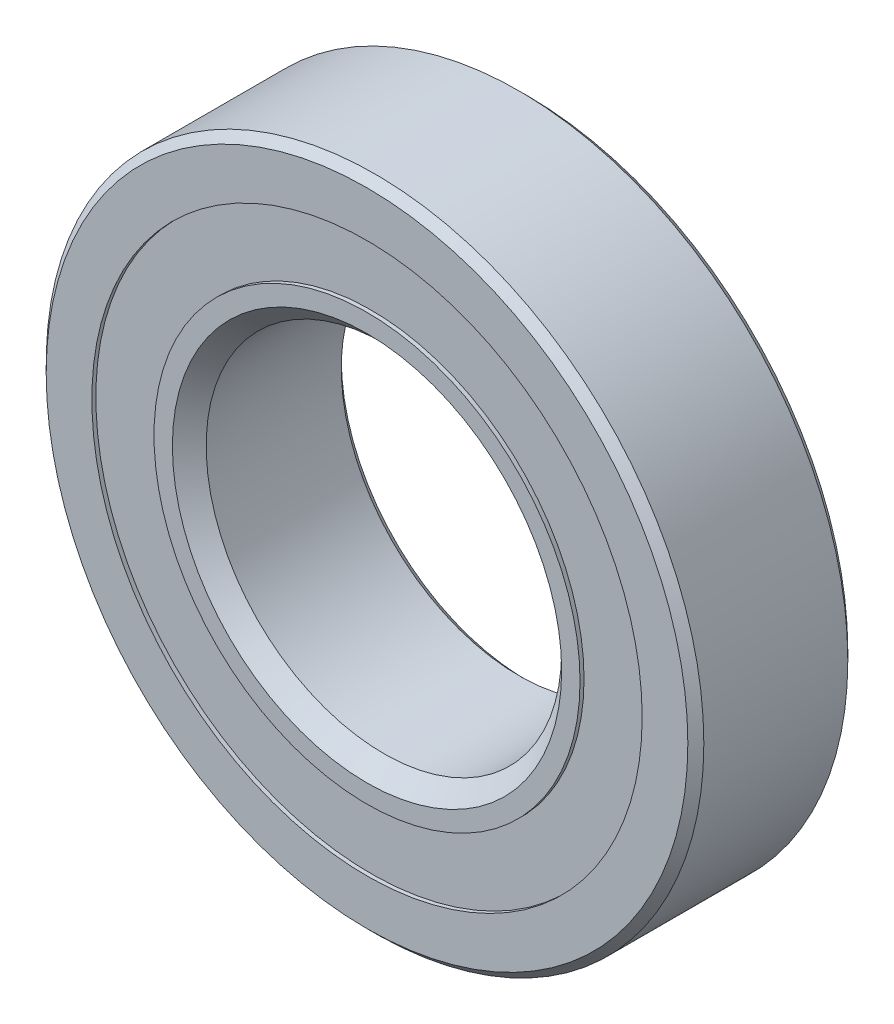
ISO-10303-21;
HEADER;
FILE_DESCRIPTION(('STEP AP214'),'2;1');
FILE_NAME('part.step','',(''),(''),'','','');
FILE_SCHEMA(('AUTOMOTIVE_DESIGN { 1 0 10303 214 1 1 1 1 }'));
ENDSEC;
DATA;
#1=APPLICATION_CONTEXT('core data for automotive mechanical design processes');
#2=APPLICATION_PROTOCOL_DEFINITION('international standard','automotive_design',2000,#1);
#3=PRODUCT_CONTEXT('',#1,'mechanical');
#4=PRODUCT('Part','Part','',(#3));
#5=PRODUCT_RELATED_PRODUCT_CATEGORY('part','',(#4));
#6=PRODUCT_DEFINITION_FORMATION('','',#4);
#7=PRODUCT_DEFINITION_CONTEXT('part definition',#1,'design');
#8=PRODUCT_DEFINITION('design','',#6,#7);
#9=PRODUCT_DEFINITION_SHAPE('','',#8);
#10=(LENGTH_UNIT() NAMED_UNIT(*) SI_UNIT(.MILLI.,.METRE.));
#11=(NAMED_UNIT(*) PLANE_ANGLE_UNIT() SI_UNIT($,.RADIAN.));
#12=(NAMED_UNIT(*) SI_UNIT($,.STERADIAN.) SOLID_ANGLE_UNIT());
#13=UNCERTAINTY_MEASURE_WITH_UNIT(LENGTH_MEASURE(1.E-05),#10,'distance_accuracy_value','');
#14=(GEOMETRIC_REPRESENTATION_CONTEXT(3) GLOBAL_UNCERTAINTY_ASSIGNED_CONTEXT((#13)) GLOBAL_UNIT_ASSIGNED_CONTEXT((#10,
#11,#12)) REPRESENTATION_CONTEXT('',''));
#15=CARTESIAN_POINT('',(0.,0.,0.));
#16=DIRECTION('',(0.,0.,1.));
#17=DIRECTION('',(1.,0.,0.));
#18=AXIS2_PLACEMENT_3D('',#15,#16,#17);
#19=CARTESIAN_POINT('',(0.,15.4807692307692,-4.275));
#20=DIRECTION('',(0.,0.,1.));
#21=DIRECTION('',(1.,0.,0.));
#22=AXIS2_PLACEMENT_3D('',#19,#20,#21);
#23=PLANE('',#22);
#24=CARTESIAN_POINT('',(0.,0.,-4.275));
#25=DIRECTION('',(0.,0.,1.));
#26=DIRECTION('',(1.,0.,0.));
#27=AXIS2_PLACEMENT_3D('',#24,#25,#26);
#28=CIRCLE('',#27,15.4807692307692);
#29=CARTESIAN_POINT('',(15.4807692307692,0.,-4.275));
#30=VERTEX_POINT('',#29);
#31=EDGE_CURVE('E58',#30,#30,#28,.T.);
#32=ORIENTED_EDGE('',*,*,#31,.F.);
#33=EDGE_LOOP('',(#32));
#34=FACE_BOUND('',#33,.T.);
#35=CARTESIAN_POINT('',(0.,0.,-4.275));
#36=DIRECTION('',(0.,0.,1.));
#37=DIRECTION('',(1.,0.,0.));
#38=AXIS2_PLACEMENT_3D('',#35,#36,#37);
#39=CIRCLE('',#38,11.9850254799049);
#40=CARTESIAN_POINT('',(11.9850254799049,0.,-4.275));
#41=VERTEX_POINT('',#40);
#42=EDGE_CURVE('E11',#41,#41,#39,.T.);
#43=ORIENTED_EDGE('',*,*,#42,.T.);
#44=EDGE_LOOP('',(#43));
#45=FACE_BOUND('',#44,.T.);
#46=ADVANCED_FACE('F44',(#34,#45),#23,.F.);
#47=CARTESIAN_POINT('',(0.,0.,4.5));
#48=DIRECTION('',(0.,0.,1.));
#49=DIRECTION('',(1.,0.,0.));
#50=AXIS2_PLACEMENT_3D('',#47,#48,#49);
#51=CYLINDRICAL_SURFACE('',#50,11.9850254799049);
#52=ORIENTED_EDGE('',*,*,#42,.F.);
#53=EDGE_LOOP('',(#52));
#54=FACE_BOUND('',#53,.T.);
#55=CARTESIAN_POINT('',(0.,0.,-2.34835961884212));
#56=DIRECTION('',(0.,0.,1.));
#57=DIRECTION('',(1.,0.,0.));
#58=AXIS2_PLACEMENT_3D('',#55,#56,#57);
#59=CIRCLE('',#58,11.9850254799049);
#60=CARTESIAN_POINT('',(11.9850254799049,0.,-2.34835961884212));
#61=VERTEX_POINT('',#60);
#62=EDGE_CURVE('E50',#61,#61,#59,.T.);
#63=ORIENTED_EDGE('',*,*,#62,.T.);
#64=EDGE_LOOP('',(#63));
#65=FACE_BOUND('',#64,.T.);
#66=ADVANCED_FACE('F67',(#54,#65),#51,.F.);
#67=CARTESIAN_POINT('',(0.,15.4807692307692,-2.34835961884211));
#68=DIRECTION('',(0.,0.,-1.));
#69=DIRECTION('',(-1.,0.,0.));
#70=AXIS2_PLACEMENT_3D('',#67,#68,#69);
#71=PLANE('',#70);
#72=ORIENTED_EDGE('',*,*,#62,.F.);
#73=EDGE_LOOP('',(#72));
#74=FACE_BOUND('',#73,.T.);
#75=CARTESIAN_POINT('',(0.,0.,-2.34835961884211));
#76=DIRECTION('',(0.,0.,1.));
#77=DIRECTION('',(1.,0.,0.));
#78=AXIS2_PLACEMENT_3D('',#75,#76,#77);
#79=CIRCLE('',#78,15.4807692307692);
#80=CARTESIAN_POINT('',(15.4807692307692,0.,-2.34835961884211));
#81=VERTEX_POINT('',#80);
#82=EDGE_CURVE('E54',#81,#81,#79,.T.);
#83=ORIENTED_EDGE('',*,*,#82,.T.);
#84=EDGE_LOOP('',(#83));
#85=FACE_BOUND('',#84,.T.);
#86=ADVANCED_FACE('F71',(#74,#85),#71,.F.);
#87=CARTESIAN_POINT('',(0.,0.,4.5));
#88=DIRECTION('',(0.,0.,1.));
#89=DIRECTION('',(1.,0.,0.));
#90=AXIS2_PLACEMENT_3D('',#87,#88,#89);
#91=CYLINDRICAL_SURFACE('',#90,15.4807692307692);
#92=ORIENTED_EDGE('',*,*,#82,.F.);
#93=EDGE_LOOP('',(#92));
#94=FACE_BOUND('',#93,.T.);
#95=ORIENTED_EDGE('',*,*,#31,.T.);
#96=EDGE_LOOP('',(#95));
#97=FACE_BOUND('',#96,.T.);
#98=ADVANCED_FACE('F64',(#94,#97),#91,.T.);
#99=CLOSED_SHELL('',(#46,#66,#86,#98));
#100=MANIFOLD_SOLID_BREP('B2',#99);
#101=CARTESIAN_POINT('',(0.,15.4807692307692,4.275));
#102=DIRECTION('',(0.,0.,-1.));
#103=DIRECTION('',(-1.,0.,0.));
#104=AXIS2_PLACEMENT_3D('',#101,#102,#103);
#105=PLANE('',#104);
#106=CARTESIAN_POINT('',(0.,0.,4.275));
#107=DIRECTION('',(0.,0.,1.));
#108=DIRECTION('',(1.,0.,0.));
#109=AXIS2_PLACEMENT_3D('',#106,#107,#108);
#110=CIRCLE('',#109,11.9850254799049);
#111=CARTESIAN_POINT('',(11.9850254799049,0.,4.275));
#112=VERTEX_POINT('',#111);
#113=EDGE_CURVE('E43',#112,#112,#110,.T.);
#114=ORIENTED_EDGE('',*,*,#113,.F.);
#115=EDGE_LOOP('',(#114));
#116=FACE_BOUND('',#115,.T.);
#117=CARTESIAN_POINT('',(0.,0.,4.275));
#118=DIRECTION('',(0.,0.,1.));
#119=DIRECTION('',(1.,0.,0.));
#120=AXIS2_PLACEMENT_3D('',#117,#118,#119);
#121=CIRCLE('',#120,15.4807692307692);
#122=CARTESIAN_POINT('',(15.4807692307692,0.,4.275));
#123=VERTEX_POINT('',#122);
#124=EDGE_CURVE('E126',#123,#123,#121,.T.);
#125=ORIENTED_EDGE('',*,*,#124,.T.);
#126=EDGE_LOOP('',(#125));
#127=FACE_BOUND('',#126,.T.);
#128=ADVANCED_FACE('F112',(#116,#127),#105,.F.);
#129=CARTESIAN_POINT('',(0.,0.,4.5));
#130=DIRECTION('',(0.,0.,1.));
#131=DIRECTION('',(1.,0.,0.));
#132=AXIS2_PLACEMENT_3D('',#129,#130,#131);
#133=CYLINDRICAL_SURFACE('',#132,11.9850254799049);
#134=CARTESIAN_POINT('',(0.,0.,2.34835961884211));
#135=DIRECTION('',(0.,0.,1.));
#136=DIRECTION('',(1.,0.,0.));
#137=AXIS2_PLACEMENT_3D('',#134,#135,#136);
#138=CIRCLE('',#137,11.9850254799049);
#139=CARTESIAN_POINT('',(11.9850254799049,0.,2.34835961884211));
#140=VERTEX_POINT('',#139);
#141=EDGE_CURVE('E118',#140,#140,#138,.T.);
#142=ORIENTED_EDGE('',*,*,#141,.F.);
#143=EDGE_LOOP('',(#142));
#144=FACE_BOUND('',#143,.T.);
#145=ORIENTED_EDGE('',*,*,#113,.T.);
#146=EDGE_LOOP('',(#145));
#147=FACE_BOUND('',#146,.T.);
#148=ADVANCED_FACE('F141',(#144,#147),#133,.F.);
#149=CARTESIAN_POINT('',(0.,15.4807692307692,2.34835961884211));
#150=DIRECTION('',(0.,0.,1.));
#151=DIRECTION('',(1.,0.,0.));
#152=AXIS2_PLACEMENT_3D('',#149,#150,#151);
#153=PLANE('',#152);
#154=CARTESIAN_POINT('',(0.,0.,2.34835961884211));
#155=DIRECTION('',(0.,0.,1.));
#156=DIRECTION('',(1.,0.,0.));
#157=AXIS2_PLACEMENT_3D('',#154,#155,#156);
#158=CIRCLE('',#157,15.4807692307692);
#159=CARTESIAN_POINT('',(15.4807692307692,0.,2.34835961884211));
#160=VERTEX_POINT('',#159);
#161=EDGE_CURVE('E122',#160,#160,#158,.T.);
#162=ORIENTED_EDGE('',*,*,#161,.F.);
#163=EDGE_LOOP('',(#162));
#164=FACE_BOUND('',#163,.T.);
#165=ORIENTED_EDGE('',*,*,#141,.T.);
#166=EDGE_LOOP('',(#165));
#167=FACE_BOUND('',#166,.T.);
#168=ADVANCED_FACE('F136',(#164,#167),#153,.F.);
#169=CARTESIAN_POINT('',(0.,0.,4.5));
#170=DIRECTION('',(0.,0.,1.));
#171=DIRECTION('',(1.,0.,0.));
#172=AXIS2_PLACEMENT_3D('',#169,#170,#171);
#173=CYLINDRICAL_SURFACE('',#172,15.4807692307692);
#174=ORIENTED_EDGE('',*,*,#124,.F.);
#175=EDGE_LOOP('',(#174));
#176=FACE_BOUND('',#175,.T.);
#177=ORIENTED_EDGE('',*,*,#161,.T.);
#178=EDGE_LOOP('',(#177));
#179=FACE_BOUND('',#178,.T.);
#180=ADVANCED_FACE('F133',(#176,#179),#173,.T.);
#181=CLOSED_SHELL('',(#128,#148,#168,#180));
#182=MANIFOLD_SOLID_BREP('B6',#181);
#183=CARTESIAN_POINT('',(-7.12499999999984,12.3408620039283,0.));
#184=DIRECTION('',(0.,0.,1.));
#185=DIRECTION('',(-0.499999999999989,0.866025403784445,0.));
#186=AXIS2_PLACEMENT_3D('',#183,#184,#185);
#187=SPHERICAL_SURFACE('',#186,2.34835961884211);
#188=CARTESIAN_POINT('',(-7.12499999999984,12.3408620039283,2.34835961884211));
#189=VERTEX_POINT('',#188);
#190=VERTEX_LOOP('',#189);
#191=FACE_BOUND('',#190,.T.);
#192=ADVANCED_FACE('F194',(#191),#187,.T.);
#193=CLOSED_SHELL('',(#192));
#194=MANIFOLD_SOLID_BREP('B38',#193);
#195=CARTESIAN_POINT('',(-12.3408620039282,7.12500000000014,0.));
#196=DIRECTION('',(0.,0.,1.));
#197=DIRECTION('',(-0.866025403784433,0.50000000000001,0.));
#198=AXIS2_PLACEMENT_3D('',#195,#196,#197);
#199=SPHERICAL_SURFACE('',#198,2.34835961884211);
#200=CARTESIAN_POINT('',(-12.3408620039282,7.12500000000014,2.34835961884211));
#201=VERTEX_POINT('',#200);
#202=VERTEX_LOOP('',#201);
#203=FACE_BOUND('',#202,.T.);
#204=ADVANCED_FACE('F227',(#203),#199,.T.);
#205=CLOSED_SHELL('',(#204));
#206=MANIFOLD_SOLID_BREP('B108',#205);
#207=CARTESIAN_POINT('',(-14.25,1.49260827235544E-13,0.));
#208=DIRECTION('',(0.,0.,1.));
#209=DIRECTION('',(-1.,0.,0.));
#210=AXIS2_PLACEMENT_3D('',#207,#208,#209);
#211=SPHERICAL_SURFACE('',#210,2.34835961884211);
#212=CARTESIAN_POINT('',(-14.25,1.49260827235544E-13,2.34835961884211));
#213=VERTEX_POINT('',#212);
#214=VERTEX_LOOP('',#213);
#215=FACE_BOUND('',#214,.T.);
#216=ADVANCED_FACE('F260',(#215),#211,.T.);
#217=CLOSED_SHELL('',(#216));
#218=MANIFOLD_SOLID_BREP('B190',#217);
#219=CARTESIAN_POINT('',(-12.3408620039283,-7.12499999999988,0.));
#220=DIRECTION('',(0.,0.,1.));
#221=DIRECTION('',(-0.866025403784443,-0.499999999999992,0.));
#222=AXIS2_PLACEMENT_3D('',#219,#220,#221);
#223=SPHERICAL_SURFACE('',#222,2.34835961884211);
#224=CARTESIAN_POINT('',(-12.3408620039283,-7.12499999999988,2.34835961884211));
#225=VERTEX_POINT('',#224);
#226=VERTEX_LOOP('',#225);
#227=FACE_BOUND('',#226,.T.);
#228=ADVANCED_FACE('F293',(#227),#223,.T.);
#229=CLOSED_SHELL('',(#228));
#230=MANIFOLD_SOLID_BREP('B223',#229);
#231=CARTESIAN_POINT('',(-7.1250000000001,-12.3408620039282,0.));
#232=DIRECTION('',(0.,0.,1.));
#233=DIRECTION('',(-0.500000000000007,-0.866025403784435,0.));
#234=AXIS2_PLACEMENT_3D('',#231,#232,#233);
#235=SPHERICAL_SURFACE('',#234,2.34835961884211);
#236=CARTESIAN_POINT('',(-7.1250000000001,-12.3408620039282,2.34835961884211));
#237=VERTEX_POINT('',#236);
#238=VERTEX_LOOP('',#237);
#239=FACE_BOUND('',#238,.T.);
#240=ADVANCED_FACE('F326',(#239),#235,.T.);
#241=CLOSED_SHELL('',(#240));
#242=MANIFOLD_SOLID_BREP('B256',#241);
#243=CARTESIAN_POINT('',(0.,-14.25,0.));
#244=DIRECTION('',(0.,0.,1.));
#245=DIRECTION('',(0.,-1.,0.));
#246=AXIS2_PLACEMENT_3D('',#243,#244,#245);
#247=SPHERICAL_SURFACE('',#246,2.34835961884211);
#248=CARTESIAN_POINT('',(0.,-14.25,2.34835961884211));
#249=VERTEX_POINT('',#248);
#250=VERTEX_LOOP('',#249);
#251=FACE_BOUND('',#250,.T.);
#252=ADVANCED_FACE('F359',(#251),#247,.T.);
#253=CLOSED_SHELL('',(#252));
#254=MANIFOLD_SOLID_BREP('B289',#253);
#255=CARTESIAN_POINT('',(7.12499999999993,-12.3408620039283,0.));
#256=DIRECTION('',(0.,0.,1.));
#257=DIRECTION('',(0.499999999999995,-0.866025403784442,0.));
#258=AXIS2_PLACEMENT_3D('',#255,#256,#257);
#259=SPHERICAL_SURFACE('',#258,2.34835961884211);
#260=CARTESIAN_POINT('',(7.12499999999993,-12.3408620039283,2.34835961884211));
#261=VERTEX_POINT('',#260);
#262=VERTEX_LOOP('',#261);
#263=FACE_BOUND('',#262,.T.);
#264=ADVANCED_FACE('F392',(#263),#259,.T.);
#265=CLOSED_SHELL('',(#264));
#266=MANIFOLD_SOLID_BREP('B322',#265);
#267=CARTESIAN_POINT('',(12.3408620039282,-7.12500000000006,0.));
#268=DIRECTION('',(0.,0.,1.));
#269=DIRECTION('',(0.866025403784436,-0.500000000000004,0.));
#270=AXIS2_PLACEMENT_3D('',#267,#268,#269);
#271=SPHERICAL_SURFACE('',#270,2.34835961884211);
#272=CARTESIAN_POINT('',(12.3408620039282,-7.12500000000006,2.34835961884211));
#273=VERTEX_POINT('',#272);
#274=VERTEX_LOOP('',#273);
#275=FACE_BOUND('',#274,.T.);
#276=ADVANCED_FACE('F425',(#275),#271,.T.);
#277=CLOSED_SHELL('',(#276));
#278=MANIFOLD_SOLID_BREP('B355',#277);
#279=CARTESIAN_POINT('',(14.25,0.,0.));
#280=DIRECTION('',(0.,0.,1.));
#281=DIRECTION('',(1.,0.,0.));
#282=AXIS2_PLACEMENT_3D('',#279,#280,#281);
#283=SPHERICAL_SURFACE('',#282,2.34835961884211);
#284=CARTESIAN_POINT('',(14.25,0.,2.34835961884211));
#285=VERTEX_POINT('',#284);
#286=VERTEX_LOOP('',#285);
#287=FACE_BOUND('',#286,.T.);
#288=ADVANCED_FACE('F458',(#287),#283,.T.);
#289=CLOSED_SHELL('',(#288));
#290=MANIFOLD_SOLID_BREP('B388',#289);
#291=CARTESIAN_POINT('',(12.3408620039283,7.12499999999997,0.));
#292=DIRECTION('',(0.,0.,1.));
#293=DIRECTION('',(0.86602540378444,0.499999999999998,0.));
#294=AXIS2_PLACEMENT_3D('',#291,#292,#293);
#295=SPHERICAL_SURFACE('',#294,2.34835961884211);
#296=CARTESIAN_POINT('',(12.3408620039283,7.12499999999997,2.34835961884211));
#297=VERTEX_POINT('',#296);
#298=VERTEX_LOOP('',#297);
#299=FACE_BOUND('',#298,.T.);
#300=ADVANCED_FACE('F491',(#299),#295,.T.);
#301=CLOSED_SHELL('',(#300));
#302=MANIFOLD_SOLID_BREP('B421',#301);
#303=CARTESIAN_POINT('',(7.12500000000001,12.3408620039282,0.));
#304=DIRECTION('',(0.,0.,1.));
#305=DIRECTION('',(0.500000000000001,0.866025403784438,0.));
#306=AXIS2_PLACEMENT_3D('',#303,#304,#305);
#307=SPHERICAL_SURFACE('',#306,2.34835961884211);
#308=CARTESIAN_POINT('',(7.12500000000001,12.3408620039282,2.34835961884211));
#309=VERTEX_POINT('',#308);
#310=VERTEX_LOOP('',#309);
#311=FACE_BOUND('',#310,.T.);
#312=ADVANCED_FACE('F524',(#311),#307,.T.);
#313=CLOSED_SHELL('',(#312));
#314=MANIFOLD_SOLID_BREP('B454',#313);
#315=CARTESIAN_POINT('',(0.,14.25,0.));
#316=DIRECTION('',(0.,0.,1.));
#317=DIRECTION('',(0.,1.,0.));
#318=AXIS2_PLACEMENT_3D('',#315,#316,#317);
#319=SPHERICAL_SURFACE('',#318,2.34835961884211);
#320=CARTESIAN_POINT('',(0.,14.25,2.34835961884211));
#321=VERTEX_POINT('',#320);
#322=VERTEX_LOOP('',#321);
#323=FACE_BOUND('',#322,.T.);
#324=ADVANCED_FACE('F559',(#323),#319,.T.);
#325=CLOSED_SHELL('',(#324));
#326=MANIFOLD_SOLID_BREP('B487',#325);
#327=CARTESIAN_POINT('',(0.,0.,4.5));
#328=DIRECTION('',(0.,0.,1.));
#329=DIRECTION('',(1.,0.,0.));
#330=AXIS2_PLACEMENT_3D('',#327,#328,#329);
#331=CYLINDRICAL_SURFACE('',#330,11.9850254799049);
#332=CARTESIAN_POINT('',(0.,0.,4.5));
#333=DIRECTION('',(0.,0.,1.));
#334=DIRECTION('',(1.,0.,0.));
#335=AXIS2_PLACEMENT_3D('',#332,#333,#334);
#336=CIRCLE('',#335,11.9850254799049);
#337=CARTESIAN_POINT('',(11.9850254799049,0.,4.5));
#338=VERTEX_POINT('',#337);
#339=EDGE_CURVE('E619',#338,#338,#336,.T.);
#340=ORIENTED_EDGE('',*,*,#339,.F.);
#341=EDGE_LOOP('',(#340));
#342=FACE_BOUND('',#341,.T.);
#343=CARTESIAN_POINT('',(0.,0.,4.275));
#344=DIRECTION('',(0.,0.,1.));
#345=DIRECTION('',(1.,0.,0.));
#346=AXIS2_PLACEMENT_3D('',#343,#344,#345);
#347=CIRCLE('',#346,11.9850254799049);
#348=CARTESIAN_POINT('',(11.9850254799049,0.,4.275));
#349=VERTEX_POINT('',#348);
#350=EDGE_CURVE('E558',#349,#349,#347,.T.);
#351=ORIENTED_EDGE('',*,*,#350,.T.);
#352=EDGE_LOOP('',(#351));
#353=FACE_BOUND('',#352,.T.);
#354=ADVANCED_FACE('F579',(#342,#353),#331,.T.);
#355=CARTESIAN_POINT('',(0.,11.9850254799049,4.275));
#356=DIRECTION('',(0.,0.,1.));
#357=DIRECTION('',(1.,0.,0.));
#358=AXIS2_PLACEMENT_3D('',#355,#356,#357);
#359=PLANE('',#358);
#360=ORIENTED_EDGE('',*,*,#350,.F.);
#361=EDGE_LOOP('',(#360));
#362=FACE_BOUND('',#361,.T.);
#363=CARTESIAN_POINT('',(0.,0.,4.275));
#364=DIRECTION('',(0.,0.,1.));
#365=DIRECTION('',(1.,0.,0.));
#366=AXIS2_PLACEMENT_3D('',#363,#364,#365);
#367=CIRCLE('',#366,11.7600254799049);
#368=CARTESIAN_POINT('',(11.7600254799049,0.,4.275));
#369=VERTEX_POINT('',#368);
#370=EDGE_CURVE('E585',#369,#369,#367,.T.);
#371=ORIENTED_EDGE('',*,*,#370,.T.);
#372=EDGE_LOOP('',(#371));
#373=FACE_BOUND('',#372,.T.);
#374=ADVANCED_FACE('F626',(#362,#373),#359,.F.);
#375=CARTESIAN_POINT('',(0.,0.,3.46579471067409));
#376=DIRECTION('',(0.,0.,1.));
#377=DIRECTION('',(1.,0.,0.));
#378=AXIS2_PLACEMENT_3D('',#375,#376,#377);
#379=CONICAL_SURFACE('',#378,10.9508201905789,0.78539816339745);
#380=ORIENTED_EDGE('',*,*,#370,.F.);
#381=EDGE_LOOP('',(#380));
#382=FACE_BOUND('',#381,.T.);
#383=CARTESIAN_POINT('',(0.,0.,3.46579471067409));
#384=DIRECTION('',(0.,0.,1.));
#385=DIRECTION('',(1.,0.,0.));
#386=AXIS2_PLACEMENT_3D('',#383,#384,#385);
#387=CIRCLE('',#386,10.9508201905789);
#388=CARTESIAN_POINT('',(10.9508201905789,0.,3.46579471067409));
#389=VERTEX_POINT('',#388);
#390=EDGE_CURVE('E589',#389,#389,#387,.T.);
#391=ORIENTED_EDGE('',*,*,#390,.T.);
#392=EDGE_LOOP('',(#391));
#393=FACE_BOUND('',#392,.T.);
#394=ADVANCED_FACE('F630',(#382,#393),#379,.T.);
#395=CARTESIAN_POINT('',(0.,0.,4.5));
#396=DIRECTION('',(0.,0.,1.));
#397=DIRECTION('',(1.,0.,0.));
#398=AXIS2_PLACEMENT_3D('',#395,#396,#397);
#399=CYLINDRICAL_SURFACE('',#398,10.9508201905789);
#400=ORIENTED_EDGE('',*,*,#390,.F.);
#401=EDGE_LOOP('',(#400));
#402=FACE_BOUND('',#401,.T.);
#403=CARTESIAN_POINT('',(0.,0.,0.));
#404=DIRECTION('',(0.,0.,1.));
#405=DIRECTION('',(1.,0.,0.));
#406=AXIS2_PLACEMENT_3D('',#403,#404,#405);
#407=CIRCLE('',#406,10.9508201905789);
#408=CARTESIAN_POINT('',(10.9508201905789,0.,0.));
#409=VERTEX_POINT('',#408);
#410=EDGE_CURVE('E593',#409,#409,#407,.T.);
#411=ORIENTED_EDGE('',*,*,#410,.T.);
#412=EDGE_LOOP('',(#411));
#413=FACE_BOUND('',#412,.T.);
#414=ADVANCED_FACE('F635',(#402,#413),#399,.T.);
#415=CARTESIAN_POINT('',(0.,10.9508201905789,0.));
#416=DIRECTION('',(0.,0.,-1.));
#417=DIRECTION('',(-1.,0.,0.));
#418=AXIS2_PLACEMENT_3D('',#415,#416,#417);
#419=PLANE('',#418);
#420=ORIENTED_EDGE('',*,*,#410,.F.);
#421=EDGE_LOOP('',(#420));
#422=FACE_BOUND('',#421,.T.);
#423=CARTESIAN_POINT('',(0.,0.,0.));
#424=DIRECTION('',(0.,0.,1.));
#425=DIRECTION('',(1.,0.,0.));
#426=AXIS2_PLACEMENT_3D('',#423,#424,#425);
#427=CIRCLE('',#426,11.9016403811579);
#428=CARTESIAN_POINT('',(11.9016403811579,0.,0.));
#429=VERTEX_POINT('',#428);
#430=EDGE_CURVE('E598',#429,#429,#427,.T.);
#431=ORIENTED_EDGE('',*,*,#430,.T.);
#432=EDGE_LOOP('',(#431));
#433=FACE_BOUND('',#432,.T.);
#434=ADVANCED_FACE('F641',(#422,#433),#419,.F.);
#435=CARTESIAN_POINT('',(0.,0.,0.));
#436=DIRECTION('',(0.,0.,1.));
#437=DIRECTION('',(1.,0.,0.));
#438=AXIS2_PLACEMENT_3D('',#435,#436,#437);
#439=TOROIDAL_SURFACE('',#438,14.25,2.34835961884211);
#440=ORIENTED_EDGE('',*,*,#430,.F.);
#441=EDGE_LOOP('',(#440));
#442=FACE_BOUND('',#441,.T.);
#443=CARTESIAN_POINT('',(0.,0.,-2.));
#444=DIRECTION('',(0.,0.,1.));
#445=DIRECTION('',(1.,0.,0.));
#446=AXIS2_PLACEMENT_3D('',#443,#444,#445);
#447=CIRCLE('',#446,13.0192307692308);
#448=CARTESIAN_POINT('',(13.0192307692308,0.,-2.));
#449=VERTEX_POINT('',#448);
#450=EDGE_CURVE('E601',#449,#449,#447,.T.);
#451=ORIENTED_EDGE('',*,*,#450,.T.);
#452=EDGE_LOOP('',(#451));
#453=FACE_BOUND('',#452,.T.);
#454=ADVANCED_FACE('F645',(#442,#453),#439,.F.);
#455=CARTESIAN_POINT('',(0.,0.,4.5));
#456=DIRECTION('',(0.,0.,1.));
#457=DIRECTION('',(1.,0.,0.));
#458=AXIS2_PLACEMENT_3D('',#455,#456,#457);
#459=CYLINDRICAL_SURFACE('',#458,13.0192307692308);
#460=ORIENTED_EDGE('',*,*,#450,.F.);
#461=EDGE_LOOP('',(#460));
#462=FACE_BOUND('',#461,.T.);
#463=CARTESIAN_POINT('',(0.,0.,-4.5));
#464=DIRECTION('',(0.,0.,1.));
#465=DIRECTION('',(1.,0.,0.));
#466=AXIS2_PLACEMENT_3D('',#463,#464,#465);
#467=CIRCLE('',#466,13.0192307692308);
#468=CARTESIAN_POINT('',(13.0192307692308,0.,-4.5));
#469=VERTEX_POINT('',#468);
#470=EDGE_CURVE('E604',#469,#469,#467,.T.);
#471=ORIENTED_EDGE('',*,*,#470,.T.);
#472=EDGE_LOOP('',(#471));
#473=FACE_BOUND('',#472,.T.);
#474=ADVANCED_FACE('F649',(#462,#473),#459,.T.);
#475=CARTESIAN_POINT('',(0.,10.45,-4.5));
#476=DIRECTION('',(0.,0.,1.));
#477=DIRECTION('',(1.,0.,0.));
#478=AXIS2_PLACEMENT_3D('',#475,#476,#477);
#479=PLANE('',#478);
#480=ORIENTED_EDGE('',*,*,#470,.F.);
#481=EDGE_LOOP('',(#480));
#482=FACE_BOUND('',#481,.T.);
#483=CARTESIAN_POINT('',(0.,0.,-4.5));
#484=DIRECTION('',(0.,0.,1.));
#485=DIRECTION('',(1.,0.,0.));
#486=AXIS2_PLACEMENT_3D('',#483,#484,#485);
#487=CIRCLE('',#486,10.45);
#488=CARTESIAN_POINT('',(10.45,0.,-4.5));
#489=VERTEX_POINT('',#488);
#490=EDGE_CURVE('E607',#489,#489,#487,.T.);
#491=ORIENTED_EDGE('',*,*,#490,.T.);
#492=EDGE_LOOP('',(#491));
#493=FACE_BOUND('',#492,.T.);
#494=ADVANCED_FACE('F653',(#482,#493),#479,.F.);
#495=CARTESIAN_POINT('',(0.,0.,-4.05));
#496=DIRECTION('',(0.,0.,-1.));
#497=DIRECTION('',(-1.,0.,0.));
#498=AXIS2_PLACEMENT_3D('',#495,#496,#497);
#499=CONICAL_SURFACE('',#498,10.,0.785398163397448);
#500=ORIENTED_EDGE('',*,*,#490,.F.);
#501=EDGE_LOOP('',(#500));
#502=FACE_BOUND('',#501,.T.);
#503=CARTESIAN_POINT('',(0.,0.,-4.05));
#504=DIRECTION('',(0.,0.,1.));
#505=DIRECTION('',(1.,0.,0.));
#506=AXIS2_PLACEMENT_3D('',#503,#504,#505);
#507=CIRCLE('',#506,10.);
#508=CARTESIAN_POINT('',(10.,0.,-4.05));
#509=VERTEX_POINT('',#508);
#510=EDGE_CURVE('E610',#509,#509,#507,.T.);
#511=ORIENTED_EDGE('',*,*,#510,.T.);
#512=EDGE_LOOP('',(#511));
#513=FACE_BOUND('',#512,.T.);
#514=ADVANCED_FACE('F657',(#502,#513),#499,.F.);
#515=CARTESIAN_POINT('',(0.,0.,4.5));
#516=DIRECTION('',(0.,0.,1.));
#517=DIRECTION('',(1.,0.,0.));
#518=AXIS2_PLACEMENT_3D('',#515,#516,#517);
#519=CYLINDRICAL_SURFACE('',#518,10.);
#520=ORIENTED_EDGE('',*,*,#510,.F.);
#521=EDGE_LOOP('',(#520));
#522=FACE_BOUND('',#521,.T.);
#523=CARTESIAN_POINT('',(0.,0.,3.54917980942106));
#524=DIRECTION('',(0.,0.,1.));
#525=DIRECTION('',(1.,0.,0.));
#526=AXIS2_PLACEMENT_3D('',#523,#524,#525);
#527=CIRCLE('',#526,10.);
#528=CARTESIAN_POINT('',(10.,0.,3.54917980942106));
#529=VERTEX_POINT('',#528);
#530=EDGE_CURVE('E613',#529,#529,#527,.T.);
#531=ORIENTED_EDGE('',*,*,#530,.T.);
#532=EDGE_LOOP('',(#531));
#533=FACE_BOUND('',#532,.T.);
#534=ADVANCED_FACE('F661',(#522,#533),#519,.F.);
#535=CARTESIAN_POINT('',(0.,0.,4.5));
#536=DIRECTION('',(0.,0.,1.));
#537=DIRECTION('',(1.,0.,0.));
#538=AXIS2_PLACEMENT_3D('',#535,#536,#537);
#539=CONICAL_SURFACE('',#538,10.9508201905789,0.78539816339745);
#540=ORIENTED_EDGE('',*,*,#530,.F.);
#541=EDGE_LOOP('',(#540));
#542=FACE_BOUND('',#541,.T.);
#543=CARTESIAN_POINT('',(0.,0.,4.5));
#544=DIRECTION('',(0.,0.,1.));
#545=DIRECTION('',(1.,0.,0.));
#546=AXIS2_PLACEMENT_3D('',#543,#544,#545);
#547=CIRCLE('',#546,10.9508201905789);
#548=CARTESIAN_POINT('',(10.9508201905789,0.,4.5));
#549=VERTEX_POINT('',#548);
#550=EDGE_CURVE('E616',#549,#549,#547,.T.);
#551=ORIENTED_EDGE('',*,*,#550,.T.);
#552=EDGE_LOOP('',(#551));
#553=FACE_BOUND('',#552,.T.);
#554=ADVANCED_FACE('F665',(#542,#553),#539,.F.);
#555=CARTESIAN_POINT('',(0.,11.9850254799049,4.5));
#556=DIRECTION('',(0.,0.,-1.));
#557=DIRECTION('',(-1.,0.,0.));
#558=AXIS2_PLACEMENT_3D('',#555,#556,#557);
#559=PLANE('',#558);
#560=ORIENTED_EDGE('',*,*,#550,.F.);
#561=EDGE_LOOP('',(#560));
#562=FACE_BOUND('',#561,.T.);
#563=ORIENTED_EDGE('',*,*,#339,.T.);
#564=EDGE_LOOP('',(#563));
#565=FACE_BOUND('',#564,.T.);
#566=ADVANCED_FACE('F623',(#562,#565),#559,.F.);
#567=CLOSED_SHELL('',(#354,#374,#394,#414,#434,#454,#474,#494,#514,#534,#554,#566));
#568=MANIFOLD_SOLID_BREP('B520',#567);
#569=CARTESIAN_POINT('',(0.,0.,4.05));
#570=DIRECTION('',(0.,0.,-1.));
#571=DIRECTION('',(-1.,0.,0.));
#572=AXIS2_PLACEMENT_3D('',#569,#570,#571);
#573=CONICAL_SURFACE('',#572,18.5,0.785398163397447);
#574=CARTESIAN_POINT('',(0.,0.,4.5));
#575=DIRECTION('',(0.,0.,1.));
#576=DIRECTION('',(1.,0.,0.));
#577=AXIS2_PLACEMENT_3D('',#574,#575,#576);
#578=CIRCLE('',#577,18.05);
#579=CARTESIAN_POINT('',(18.05,0.,4.5));
#580=VERTEX_POINT('',#579);
#581=EDGE_CURVE('E789',#580,#580,#578,.T.);
#582=ORIENTED_EDGE('',*,*,#581,.F.);
#583=EDGE_LOOP('',(#582));
#584=FACE_BOUND('',#583,.T.);
#585=CARTESIAN_POINT('',(0.,0.,4.05));
#586=DIRECTION('',(0.,0.,1.));
#587=DIRECTION('',(1.,0.,0.));
#588=AXIS2_PLACEMENT_3D('',#585,#586,#587);
#589=CIRCLE('',#588,18.5);
#590=CARTESIAN_POINT('',(18.5,0.,4.05));
#591=VERTEX_POINT('',#590);
#592=EDGE_CURVE('E578',#591,#591,#589,.T.);
#593=ORIENTED_EDGE('',*,*,#592,.T.);
#594=EDGE_LOOP('',(#593));
#595=FACE_BOUND('',#594,.T.);
#596=ADVANCED_FACE('F761',(#584,#595),#573,.T.);
#597=CARTESIAN_POINT('',(0.,0.,4.5));
#598=DIRECTION('',(0.,0.,1.));
#599=DIRECTION('',(1.,0.,0.));
#600=AXIS2_PLACEMENT_3D('',#597,#598,#599);
#601=CYLINDRICAL_SURFACE('',#600,18.5);
#602=ORIENTED_EDGE('',*,*,#592,.F.);
#603=EDGE_LOOP('',(#602));
#604=FACE_BOUND('',#603,.T.);
#605=CARTESIAN_POINT('',(0.,0.,-4.05));
#606=DIRECTION('',(0.,0.,1.));
#607=DIRECTION('',(1.,0.,0.));
#608=AXIS2_PLACEMENT_3D('',#605,#606,#607);
#609=CIRCLE('',#608,18.5);
#610=CARTESIAN_POINT('',(18.5,0.,-4.05));
#611=VERTEX_POINT('',#610);
#612=EDGE_CURVE('E767',#611,#611,#609,.T.);
#613=ORIENTED_EDGE('',*,*,#612,.T.);
#614=EDGE_LOOP('',(#613));
#615=FACE_BOUND('',#614,.T.);
#616=ADVANCED_FACE('F796',(#604,#615),#601,.T.);
#617=CARTESIAN_POINT('',(0.,0.,-4.5));
#618=DIRECTION('',(0.,0.,1.));
#619=DIRECTION('',(1.,0.,0.));
#620=AXIS2_PLACEMENT_3D('',#617,#618,#619);
#621=CONICAL_SURFACE('',#620,18.05,0.785398163397446);
#622=ORIENTED_EDGE('',*,*,#612,.F.);
#623=EDGE_LOOP('',(#622));
#624=FACE_BOUND('',#623,.T.);
#625=CARTESIAN_POINT('',(0.,0.,-4.5));
#626=DIRECTION('',(0.,0.,1.));
#627=DIRECTION('',(1.,0.,0.));
#628=AXIS2_PLACEMENT_3D('',#625,#626,#627);
#629=CIRCLE('',#628,18.05);
#630=CARTESIAN_POINT('',(18.05,0.,-4.5));
#631=VERTEX_POINT('',#630);
#632=EDGE_CURVE('E771',#631,#631,#629,.T.);
#633=ORIENTED_EDGE('',*,*,#632,.T.);
#634=EDGE_LOOP('',(#633));
#635=FACE_BOUND('',#634,.T.);
#636=ADVANCED_FACE('F800',(#624,#635),#621,.T.);
#637=CARTESIAN_POINT('',(0.,18.05,-4.5));
#638=DIRECTION('',(0.,0.,1.));
#639=DIRECTION('',(1.,0.,0.));
#640=AXIS2_PLACEMENT_3D('',#637,#638,#639);
#641=PLANE('',#640);
#642=ORIENTED_EDGE('',*,*,#632,.F.);
#643=EDGE_LOOP('',(#642));
#644=FACE_BOUND('',#643,.T.);
#645=CARTESIAN_POINT('',(0.,0.,-4.5));
#646=DIRECTION('',(0.,0.,1.));
#647=DIRECTION('',(1.,0.,0.));
#648=AXIS2_PLACEMENT_3D('',#645,#646,#647);
#649=CIRCLE('',#648,15.4807692307692);
#650=CARTESIAN_POINT('',(15.4807692307692,0.,-4.5));
#651=VERTEX_POINT('',#650);
#652=EDGE_CURVE('E775',#651,#651,#649,.T.);
#653=ORIENTED_EDGE('',*,*,#652,.T.);
#654=EDGE_LOOP('',(#653));
#655=FACE_BOUND('',#654,.T.);
#656=ADVANCED_FACE('F805',(#644,#655),#641,.F.);
#657=CARTESIAN_POINT('',(0.,0.,4.5));
#658=DIRECTION('',(0.,0.,1.));
#659=DIRECTION('',(1.,0.,0.));
#660=AXIS2_PLACEMENT_3D('',#657,#658,#659);
#661=CYLINDRICAL_SURFACE('',#660,15.4807692307692);
#662=ORIENTED_EDGE('',*,*,#652,.F.);
#663=EDGE_LOOP('',(#662));
#664=FACE_BOUND('',#663,.T.);
#665=CARTESIAN_POINT('',(0.,0.,-2.));
#666=DIRECTION('',(0.,0.,1.));
#667=DIRECTION('',(1.,0.,0.));
#668=AXIS2_PLACEMENT_3D('',#665,#666,#667);
#669=CIRCLE('',#668,15.4807692307692);
#670=CARTESIAN_POINT('',(15.4807692307692,0.,-2.));
#671=VERTEX_POINT('',#670);
#672=EDGE_CURVE('E780',#671,#671,#669,.T.);
#673=ORIENTED_EDGE('',*,*,#672,.T.);
#674=EDGE_LOOP('',(#673));
#675=FACE_BOUND('',#674,.T.);
#676=ADVANCED_FACE('F811',(#664,#675),#661,.F.);
#677=CARTESIAN_POINT('',(0.,0.,0.));
#678=DIRECTION('',(0.,0.,1.));
#679=DIRECTION('',(1.,0.,0.));
#680=AXIS2_PLACEMENT_3D('',#677,#678,#679);
#681=TOROIDAL_SURFACE('',#680,14.25,2.34835961884211);
#682=ORIENTED_EDGE('',*,*,#672,.F.);
#683=EDGE_LOOP('',(#682));
#684=FACE_BOUND('',#683,.T.);
#685=CARTESIAN_POINT('',(0.,0.,2.));
#686=DIRECTION('',(0.,0.,1.));
#687=DIRECTION('',(1.,0.,0.));
#688=AXIS2_PLACEMENT_3D('',#685,#686,#687);
#689=CIRCLE('',#688,15.4807692307692);
#690=CARTESIAN_POINT('',(15.4807692307692,0.,2.));
#691=VERTEX_POINT('',#690);
#692=EDGE_CURVE('E783',#691,#691,#689,.T.);
#693=ORIENTED_EDGE('',*,*,#692,.T.);
#694=EDGE_LOOP('',(#693));
#695=FACE_BOUND('',#694,.T.);
#696=ADVANCED_FACE('F815',(#684,#695),#681,.F.);
#697=CARTESIAN_POINT('',(0.,0.,4.5));
#698=DIRECTION('',(0.,0.,1.));
#699=DIRECTION('',(1.,0.,0.));
#700=AXIS2_PLACEMENT_3D('',#697,#698,#699);
#701=CYLINDRICAL_SURFACE('',#700,15.4807692307692);
#702=ORIENTED_EDGE('',*,*,#692,.F.);
#703=EDGE_LOOP('',(#702));
#704=FACE_BOUND('',#703,.T.);
#705=CARTESIAN_POINT('',(0.,0.,4.5));
#706=DIRECTION('',(0.,0.,1.));
#707=DIRECTION('',(1.,0.,0.));
#708=AXIS2_PLACEMENT_3D('',#705,#706,#707);
#709=CIRCLE('',#708,15.4807692307692);
#710=CARTESIAN_POINT('',(15.4807692307692,0.,4.5));
#711=VERTEX_POINT('',#710);
#712=EDGE_CURVE('E786',#711,#711,#709,.T.);
#713=ORIENTED_EDGE('',*,*,#712,.T.);
#714=EDGE_LOOP('',(#713));
#715=FACE_BOUND('',#714,.T.);
#716=ADVANCED_FACE('F819',(#704,#715),#701,.F.);
#717=CARTESIAN_POINT('',(0.,18.05,4.5));
#718=DIRECTION('',(0.,0.,-1.));
#719=DIRECTION('',(-1.,0.,0.));
#720=AXIS2_PLACEMENT_3D('',#717,#718,#719);
#721=PLANE('',#720);
#722=ORIENTED_EDGE('',*,*,#712,.F.);
#723=EDGE_LOOP('',(#722));
#724=FACE_BOUND('',#723,.T.);
#725=ORIENTED_EDGE('',*,*,#581,.T.);
#726=EDGE_LOOP('',(#725));
#727=FACE_BOUND('',#726,.T.);
#728=ADVANCED_FACE('F793',(#724,#727),#721,.F.);
#729=CLOSED_SHELL('',(#596,#616,#636,#656,#676,#696,#716,#728));
#730=MANIFOLD_SOLID_BREP('B553',#729);
#731=ADVANCED_BREP_SHAPE_REPRESENTATION('',(#18,#100,#182,#194,#206,#218,#230,#242,#254,#266,
#278,#290,#302,#314,#326,#568,#730),#14);
#732=SHAPE_DEFINITION_REPRESENTATION(#9,#731);
ENDSEC;
END-ISO-10303-21;
